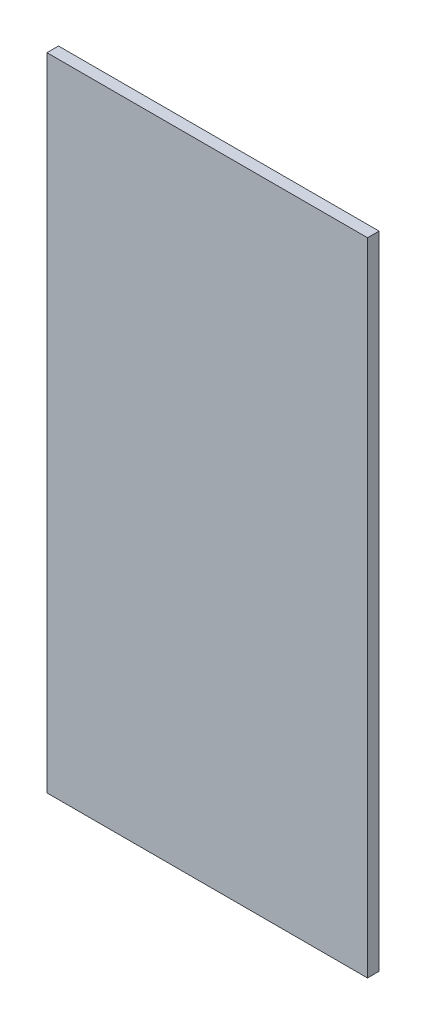
ISO-10303-21;
HEADER;
FILE_DESCRIPTION(('STEP AP214'),'2;1');
FILE_NAME('part.step','',(''),(''),'','','');
FILE_SCHEMA(('AUTOMOTIVE_DESIGN { 1 0 10303 214 1 1 1 1 }'));
ENDSEC;
DATA;
#1=APPLICATION_CONTEXT('core data for automotive mechanical design processes');
#2=APPLICATION_PROTOCOL_DEFINITION('international standard','automotive_design',2000,#1);
#3=PRODUCT_CONTEXT('',#1,'mechanical');
#4=PRODUCT('Part','Part','',(#3));
#5=PRODUCT_RELATED_PRODUCT_CATEGORY('part','',(#4));
#6=PRODUCT_DEFINITION_FORMATION('','',#4);
#7=PRODUCT_DEFINITION_CONTEXT('part definition',#1,'design');
#8=PRODUCT_DEFINITION('design','',#6,#7);
#9=PRODUCT_DEFINITION_SHAPE('','',#8);
#10=(LENGTH_UNIT() NAMED_UNIT(*) SI_UNIT(.MILLI.,.METRE.));
#11=(NAMED_UNIT(*) PLANE_ANGLE_UNIT() SI_UNIT($,.RADIAN.));
#12=(NAMED_UNIT(*) SI_UNIT($,.STERADIAN.) SOLID_ANGLE_UNIT());
#13=UNCERTAINTY_MEASURE_WITH_UNIT(LENGTH_MEASURE(1.E-05),#10,'distance_accuracy_value','');
#14=(GEOMETRIC_REPRESENTATION_CONTEXT(3) GLOBAL_UNCERTAINTY_ASSIGNED_CONTEXT((#13)) GLOBAL_UNIT_ASSIGNED_CONTEXT((#10,
#11,#12)) REPRESENTATION_CONTEXT('',''));
#15=CARTESIAN_POINT('',(0.,0.,0.));
#16=DIRECTION('',(0.,0.,1.));
#17=DIRECTION('',(1.,0.,0.));
#18=AXIS2_PLACEMENT_3D('',#15,#16,#17);
#19=CARTESIAN_POINT('',(-1.625,-0.5,-0.018));
#20=DIRECTION('',(0.,1.,0.));
#21=DIRECTION('',(0.,0.,1.));
#22=AXIS2_PLACEMENT_3D('',#19,#20,#21);
#23=PLANE('',#22);
#24=CARTESIAN_POINT('',(-1.625,-0.5,-0.018));
#25=CARTESIAN_POINT('',(-2.125,-0.5,-0.018));
#26=B_SPLINE_CURVE_WITH_KNOTS('',1,(#24,#25),.UNSPECIFIED.,.F.,.F.,(2,2),(-3.,-2.5),.UNSPECIFIED.);
#27=CARTESIAN_POINT('',(-1.625,-0.5,-0.018));
#28=VERTEX_POINT('',#27);
#29=CARTESIAN_POINT('',(-2.125,-0.5,-0.018));
#30=VERTEX_POINT('',#29);
#31=EDGE_CURVE('E11',#28,#30,#26,.T.);
#32=ORIENTED_EDGE('',*,*,#31,.T.);
#33=CARTESIAN_POINT('',(-2.125,-0.5,-0.018));
#34=CARTESIAN_POINT('',(-2.125,-0.5,0.));
#35=B_SPLINE_CURVE_WITH_KNOTS('',1,(#33,#34),.UNSPECIFIED.,.F.,.F.,(2,2),(0.,0.018),.UNSPECIFIED.);
#36=CARTESIAN_POINT('',(-2.125,-0.5,0.));
#37=VERTEX_POINT('',#36);
#38=EDGE_CURVE('E26',#30,#37,#35,.T.);
#39=ORIENTED_EDGE('',*,*,#38,.T.);
#40=CARTESIAN_POINT('',(-1.625,-0.5,0.));
#41=CARTESIAN_POINT('',(-2.125,-0.5,0.));
#42=B_SPLINE_CURVE_WITH_KNOTS('',1,(#40,#41),.UNSPECIFIED.,.F.,.F.,(2,2),(-3.,-2.5),.UNSPECIFIED.);
#43=CARTESIAN_POINT('',(-1.625,-0.5,0.));
#44=VERTEX_POINT('',#43);
#45=EDGE_CURVE('E132',#44,#37,#42,.T.);
#46=ORIENTED_EDGE('',*,*,#45,.F.);
#47=CARTESIAN_POINT('',(-1.625,-0.5,-0.018));
#48=CARTESIAN_POINT('',(-1.625,-0.5,0.));
#49=B_SPLINE_CURVE_WITH_KNOTS('',1,(#47,#48),.UNSPECIFIED.,.F.,.F.,(2,2),(0.,0.018),.UNSPECIFIED.);
#50=EDGE_CURVE('E79',#28,#44,#49,.T.);
#51=ORIENTED_EDGE('',*,*,#50,.F.);
#52=EDGE_LOOP('',(#32,#39,#46,#51));
#53=FACE_BOUND('',#52,.T.);
#54=ADVANCED_FACE('F17',(#53),#23,.T.);
#55=CARTESIAN_POINT('',(-2.125,-0.5,-0.018));
#56=DIRECTION('',(-1.,0.,0.));
#57=DIRECTION('',(0.,0.,-1.));
#58=AXIS2_PLACEMENT_3D('',#55,#56,#57);
#59=PLANE('',#58);
#60=CARTESIAN_POINT('',(-2.125,-0.5,-0.018));
#61=CARTESIAN_POINT('',(-2.125,-1.5,-0.018));
#62=B_SPLINE_CURVE_WITH_KNOTS('',1,(#60,#61),.UNSPECIFIED.,.F.,.F.,(2,2),(-2.5,-1.5),.UNSPECIFIED.);
#63=CARTESIAN_POINT('',(-2.125,-1.5,-0.018));
#64=VERTEX_POINT('',#63);
#65=EDGE_CURVE('E119',#30,#64,#62,.T.);
#66=ORIENTED_EDGE('',*,*,#65,.T.);
#67=CARTESIAN_POINT('',(-2.125,-1.5,-0.018));
#68=CARTESIAN_POINT('',(-2.125,-1.5,0.));
#69=B_SPLINE_CURVE_WITH_KNOTS('',1,(#67,#68),.UNSPECIFIED.,.F.,.F.,(2,2),(0.,0.018),.UNSPECIFIED.);
#70=CARTESIAN_POINT('',(-2.125,-1.5,0.));
#71=VERTEX_POINT('',#70);
#72=EDGE_CURVE('E112',#64,#71,#69,.T.);
#73=ORIENTED_EDGE('',*,*,#72,.T.);
#74=CARTESIAN_POINT('',(-2.125,-0.5,0.));
#75=CARTESIAN_POINT('',(-2.125,-1.5,0.));
#76=B_SPLINE_CURVE_WITH_KNOTS('',1,(#74,#75),.UNSPECIFIED.,.F.,.F.,(2,2),(-2.5,-1.5),.UNSPECIFIED.);
#77=EDGE_CURVE('E74',#37,#71,#76,.T.);
#78=ORIENTED_EDGE('',*,*,#77,.F.);
#79=ORIENTED_EDGE('',*,*,#38,.F.);
#80=EDGE_LOOP('',(#66,#73,#78,#79));
#81=FACE_BOUND('',#80,.T.);
#82=ADVANCED_FACE('F147',(#81),#59,.T.);
#83=CARTESIAN_POINT('',(-2.125,-1.5,-0.018));
#84=DIRECTION('',(0.,-1.,0.));
#85=DIRECTION('',(0.,0.,-1.));
#86=AXIS2_PLACEMENT_3D('',#83,#84,#85);
#87=PLANE('',#86);
#88=CARTESIAN_POINT('',(-2.125,-1.5,-0.018));
#89=CARTESIAN_POINT('',(-1.625,-1.5,-0.018));
#90=B_SPLINE_CURVE_WITH_KNOTS('',1,(#88,#89),.UNSPECIFIED.,.F.,.F.,(2,2),(-1.5,-1.),.UNSPECIFIED.);
#91=CARTESIAN_POINT('',(-1.625,-1.5,-0.018));
#92=VERTEX_POINT('',#91);
#93=EDGE_CURVE('E62',#64,#92,#90,.T.);
#94=ORIENTED_EDGE('',*,*,#93,.T.);
#95=CARTESIAN_POINT('',(-1.625,-1.5,-0.018));
#96=CARTESIAN_POINT('',(-1.625,-1.5,0.));
#97=B_SPLINE_CURVE_WITH_KNOTS('',1,(#95,#96),.UNSPECIFIED.,.F.,.F.,(2,2),(0.,0.018),.UNSPECIFIED.);
#98=CARTESIAN_POINT('',(-1.625,-1.5,0.));
#99=VERTEX_POINT('',#98);
#100=EDGE_CURVE('E56',#92,#99,#97,.T.);
#101=ORIENTED_EDGE('',*,*,#100,.T.);
#102=CARTESIAN_POINT('',(-2.125,-1.5,0.));
#103=CARTESIAN_POINT('',(-1.625,-1.5,0.));
#104=B_SPLINE_CURVE_WITH_KNOTS('',1,(#102,#103),.UNSPECIFIED.,.F.,.F.,(2,2),(-1.5,-1.),.UNSPECIFIED.);
#105=EDGE_CURVE('E60',#71,#99,#104,.T.);
#106=ORIENTED_EDGE('',*,*,#105,.F.);
#107=ORIENTED_EDGE('',*,*,#72,.F.);
#108=EDGE_LOOP('',(#94,#101,#106,#107));
#109=FACE_BOUND('',#108,.T.);
#110=ADVANCED_FACE('F58',(#109),#87,.T.);
#111=CARTESIAN_POINT('',(-1.625,-1.5,-0.018));
#112=DIRECTION('',(1.,0.,0.));
#113=DIRECTION('',(0.,0.,1.));
#114=AXIS2_PLACEMENT_3D('',#111,#112,#113);
#115=PLANE('',#114);
#116=CARTESIAN_POINT('',(-1.625,-1.5,-0.018));
#117=CARTESIAN_POINT('',(-1.625,-0.5,-0.018));
#118=B_SPLINE_CURVE_WITH_KNOTS('',1,(#116,#117),.UNSPECIFIED.,.F.,.F.,(2,2),(-1.,0.),.UNSPECIFIED.);
#119=EDGE_CURVE('E75',#92,#28,#118,.T.);
#120=ORIENTED_EDGE('',*,*,#119,.T.);
#121=ORIENTED_EDGE('',*,*,#50,.T.);
#122=CARTESIAN_POINT('',(-1.625,-1.5,0.));
#123=CARTESIAN_POINT('',(-1.625,-0.5,0.));
#124=B_SPLINE_CURVE_WITH_KNOTS('',1,(#122,#123),.UNSPECIFIED.,.F.,.F.,(2,2),(-1.,0.),.UNSPECIFIED.);
#125=EDGE_CURVE('E72',#99,#44,#124,.T.);
#126=ORIENTED_EDGE('',*,*,#125,.F.);
#127=ORIENTED_EDGE('',*,*,#100,.F.);
#128=EDGE_LOOP('',(#120,#121,#126,#127));
#129=FACE_BOUND('',#128,.T.);
#130=ADVANCED_FACE('F78',(#129),#115,.T.);
#131=CARTESIAN_POINT('',(-1.625,-0.5,-0.018));
#132=DIRECTION('',(0.,0.,-1.));
#133=DIRECTION('',(-1.,0.,0.));
#134=AXIS2_PLACEMENT_3D('',#131,#132,#133);
#135=PLANE('',#134);
#136=ORIENTED_EDGE('',*,*,#119,.F.);
#137=ORIENTED_EDGE('',*,*,#93,.F.);
#138=ORIENTED_EDGE('',*,*,#65,.F.);
#139=ORIENTED_EDGE('',*,*,#31,.F.);
#140=EDGE_LOOP('',(#136,#137,#138,#139));
#141=FACE_BOUND('',#140,.T.);
#142=ADVANCED_FACE('F148',(#141),#135,.T.);
#143=CARTESIAN_POINT('',(-1.625,-0.5,0.));
#144=DIRECTION('',(0.,0.,1.));
#145=DIRECTION('',(1.,0.,0.));
#146=AXIS2_PLACEMENT_3D('',#143,#144,#145);
#147=PLANE('',#146);
#148=ORIENTED_EDGE('',*,*,#45,.T.);
#149=ORIENTED_EDGE('',*,*,#77,.T.);
#150=ORIENTED_EDGE('',*,*,#105,.T.);
#151=ORIENTED_EDGE('',*,*,#125,.T.);
#152=EDGE_LOOP('',(#148,#149,#150,#151));
#153=FACE_BOUND('',#152,.T.);
#154=ADVANCED_FACE('F71',(#153),#147,.T.);
#155=CLOSED_SHELL('',(#54,#82,#110,#130,#142,#154));
#156=MANIFOLD_SOLID_BREP('B1',#155);
#157=ADVANCED_BREP_SHAPE_REPRESENTATION('',(#18,#156),#14);
#158=SHAPE_DEFINITION_REPRESENTATION(#9,#157);
ENDSEC;
END-ISO-10303-21;
